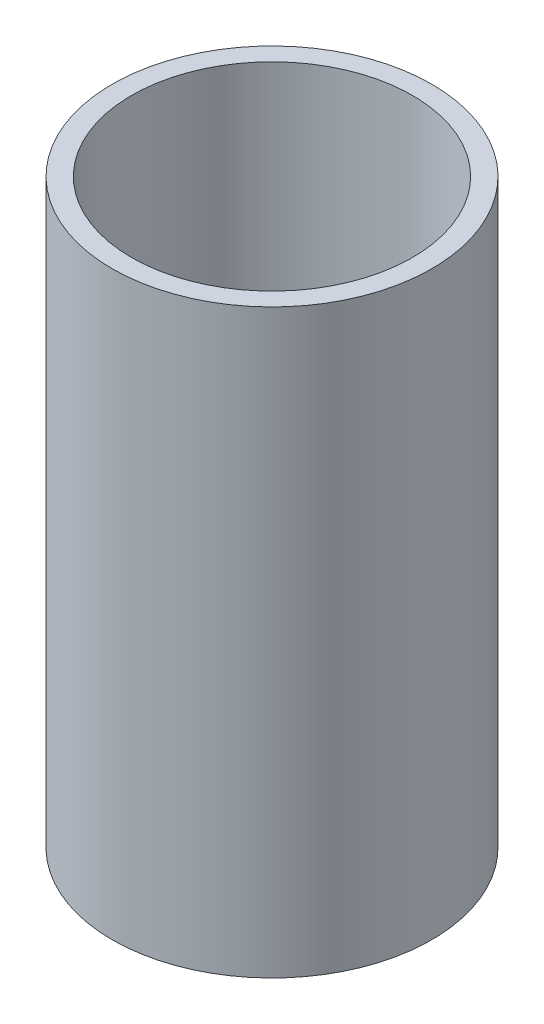
ISO-10303-21;
HEADER;
FILE_DESCRIPTION(('STEP AP214'),'2;1');
FILE_NAME('part.step','',(''),(''),'','','');
FILE_SCHEMA(('AUTOMOTIVE_DESIGN { 1 0 10303 214 1 1 1 1 }'));
ENDSEC;
DATA;
#1=APPLICATION_CONTEXT('core data for automotive mechanical design processes');
#2=APPLICATION_PROTOCOL_DEFINITION('international standard','automotive_design',2000,#1);
#3=PRODUCT_CONTEXT('',#1,'mechanical');
#4=PRODUCT('Part','Part','',(#3));
#5=PRODUCT_RELATED_PRODUCT_CATEGORY('part','',(#4));
#6=PRODUCT_DEFINITION_FORMATION('','',#4);
#7=PRODUCT_DEFINITION_CONTEXT('part definition',#1,'design');
#8=PRODUCT_DEFINITION('design','',#6,#7);
#9=PRODUCT_DEFINITION_SHAPE('','',#8);
#10=(LENGTH_UNIT() NAMED_UNIT(*) SI_UNIT(.MILLI.,.METRE.));
#11=(NAMED_UNIT(*) PLANE_ANGLE_UNIT() SI_UNIT($,.RADIAN.));
#12=(NAMED_UNIT(*) SI_UNIT($,.STERADIAN.) SOLID_ANGLE_UNIT());
#13=UNCERTAINTY_MEASURE_WITH_UNIT(LENGTH_MEASURE(1.E-05),#10,'distance_accuracy_value','');
#14=(GEOMETRIC_REPRESENTATION_CONTEXT(3) GLOBAL_UNCERTAINTY_ASSIGNED_CONTEXT((#13)) GLOBAL_UNIT_ASSIGNED_CONTEXT((#10,
#11,#12)) REPRESENTATION_CONTEXT('',''));
#15=CARTESIAN_POINT('',(0.,0.,0.));
#16=DIRECTION('',(0.,0.,1.));
#17=DIRECTION('',(1.,0.,0.));
#18=AXIS2_PLACEMENT_3D('',#15,#16,#17);
#19=CARTESIAN_POINT('',(0.,120.,0.));
#20=DIRECTION('',(0.,1.,0.));
#21=DIRECTION('',(0.,0.,1.));
#22=AXIS2_PLACEMENT_3D('',#19,#20,#21);
#23=PLANE('',#22);
#24=CARTESIAN_POINT('',(0.,120.,0.));
#25=DIRECTION('',(0.,1.,0.));
#26=DIRECTION('',(0.,0.,1.));
#27=AXIS2_PLACEMENT_3D('',#24,#25,#26);
#28=CIRCLE('',#27,33.);
#29=CARTESIAN_POINT('',(0.,120.,33.));
#30=VERTEX_POINT('',#29);
#31=EDGE_CURVE('E10',#30,#30,#28,.T.);
#32=ORIENTED_EDGE('',*,*,#31,.T.);
#33=EDGE_LOOP('',(#32));
#34=FACE_BOUND('',#33,.T.);
#35=CARTESIAN_POINT('',(0.,120.,0.));
#36=DIRECTION('',(0.,1.,0.));
#37=DIRECTION('',(0.,0.,1.));
#38=AXIS2_PLACEMENT_3D('',#35,#36,#37);
#39=CIRCLE('',#38,29.);
#40=CARTESIAN_POINT('',(0.,120.,29.));
#41=VERTEX_POINT('',#40);
#42=EDGE_CURVE('E41',#41,#41,#39,.T.);
#43=ORIENTED_EDGE('',*,*,#42,.F.);
#44=EDGE_LOOP('',(#43));
#45=FACE_BOUND('',#44,.T.);
#46=ADVANCED_FACE('F30',(#34,#45),#23,.T.);
#47=CARTESIAN_POINT('',(0.,0.,0.));
#48=DIRECTION('',(0.,1.,0.));
#49=DIRECTION('',(0.,0.,1.));
#50=AXIS2_PLACEMENT_3D('',#47,#48,#49);
#51=PLANE('',#50);
#52=CARTESIAN_POINT('',(0.,0.,0.));
#53=DIRECTION('',(0.,1.,0.));
#54=DIRECTION('',(0.,0.,1.));
#55=AXIS2_PLACEMENT_3D('',#52,#53,#54);
#56=CIRCLE('',#55,33.);
#57=CARTESIAN_POINT('',(0.,0.,33.));
#58=VERTEX_POINT('',#57);
#59=EDGE_CURVE('E34',#58,#58,#56,.T.);
#60=ORIENTED_EDGE('',*,*,#59,.F.);
#61=EDGE_LOOP('',(#60));
#62=FACE_BOUND('',#61,.T.);
#63=CARTESIAN_POINT('',(0.,0.,0.));
#64=DIRECTION('',(0.,1.,0.));
#65=DIRECTION('',(0.,0.,1.));
#66=AXIS2_PLACEMENT_3D('',#63,#64,#65);
#67=CIRCLE('',#66,29.);
#68=CARTESIAN_POINT('',(0.,0.,29.));
#69=VERTEX_POINT('',#68);
#70=EDGE_CURVE('E43',#69,#69,#67,.T.);
#71=ORIENTED_EDGE('',*,*,#70,.T.);
#72=EDGE_LOOP('',(#71));
#73=FACE_BOUND('',#72,.T.);
#74=ADVANCED_FACE('F53',(#62,#73),#51,.F.);
#75=CARTESIAN_POINT('',(0.,120.,0.));
#76=DIRECTION('',(0.,-1.,0.));
#77=DIRECTION('',(0.,0.,-1.));
#78=AXIS2_PLACEMENT_3D('',#75,#76,#77);
#79=CYLINDRICAL_SURFACE('',#78,33.);
#80=ORIENTED_EDGE('',*,*,#31,.F.);
#81=EDGE_LOOP('',(#80));
#82=FACE_BOUND('',#81,.T.);
#83=ORIENTED_EDGE('',*,*,#59,.T.);
#84=EDGE_LOOP('',(#83));
#85=FACE_BOUND('',#84,.T.);
#86=ADVANCED_FACE('F32',(#82,#85),#79,.T.);
#87=CARTESIAN_POINT('',(0.,120.,0.));
#88=DIRECTION('',(0.,-1.,0.));
#89=DIRECTION('',(0.,0.,-1.));
#90=AXIS2_PLACEMENT_3D('',#87,#88,#89);
#91=CYLINDRICAL_SURFACE('',#90,29.);
#92=ORIENTED_EDGE('',*,*,#42,.T.);
#93=EDGE_LOOP('',(#92));
#94=FACE_BOUND('',#93,.T.);
#95=ORIENTED_EDGE('',*,*,#70,.F.);
#96=EDGE_LOOP('',(#95));
#97=FACE_BOUND('',#96,.T.);
#98=ADVANCED_FACE('F49',(#94,#97),#91,.F.);
#99=CLOSED_SHELL('',(#46,#74,#86,#98));
#100=MANIFOLD_SOLID_BREP('B2',#99);
#101=ADVANCED_BREP_SHAPE_REPRESENTATION('',(#18,#100),#14);
#102=SHAPE_DEFINITION_REPRESENTATION(#9,#101);
ENDSEC;
END-ISO-10303-21;
